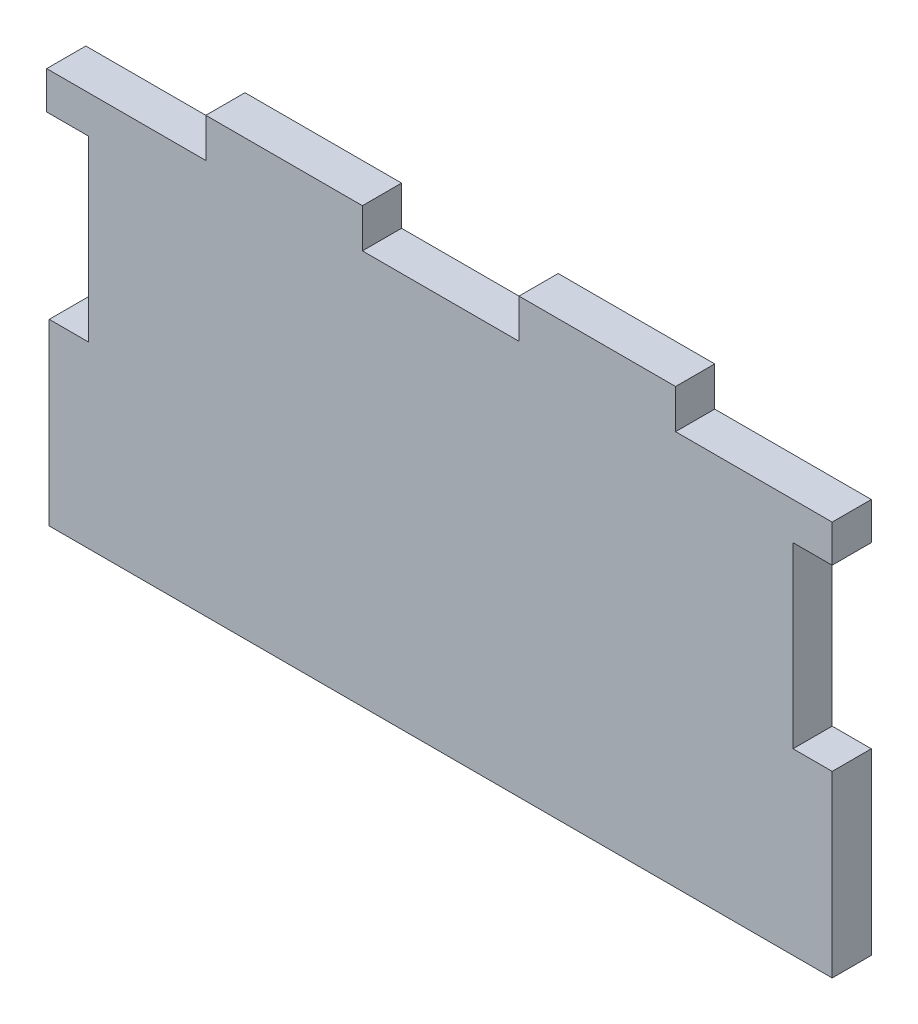
ISO-10303-21;
HEADER;
FILE_DESCRIPTION(('STEP AP214'),'2;1');
FILE_NAME('part.step','',(''),(''),'','','');
FILE_SCHEMA(('AUTOMOTIVE_DESIGN { 1 0 10303 214 1 1 1 1 }'));
ENDSEC;
DATA;
#1=APPLICATION_CONTEXT('core data for automotive mechanical design processes');
#2=APPLICATION_PROTOCOL_DEFINITION('international standard','automotive_design',2000,#1);
#3=PRODUCT_CONTEXT('',#1,'mechanical');
#4=PRODUCT('Part','Part','',(#3));
#5=PRODUCT_RELATED_PRODUCT_CATEGORY('part','',(#4));
#6=PRODUCT_DEFINITION_FORMATION('','',#4);
#7=PRODUCT_DEFINITION_CONTEXT('part definition',#1,'design');
#8=PRODUCT_DEFINITION('design','',#6,#7);
#9=PRODUCT_DEFINITION_SHAPE('','',#8);
#10=(LENGTH_UNIT() NAMED_UNIT(*) SI_UNIT(.MILLI.,.METRE.));
#11=(NAMED_UNIT(*) PLANE_ANGLE_UNIT() SI_UNIT($,.RADIAN.));
#12=(NAMED_UNIT(*) SI_UNIT($,.STERADIAN.) SOLID_ANGLE_UNIT());
#13=UNCERTAINTY_MEASURE_WITH_UNIT(LENGTH_MEASURE(1.E-05),#10,'distance_accuracy_value','');
#14=(GEOMETRIC_REPRESENTATION_CONTEXT(3) GLOBAL_UNCERTAINTY_ASSIGNED_CONTEXT((#13)) GLOBAL_UNIT_ASSIGNED_CONTEXT((#10,
#11,#12)) REPRESENTATION_CONTEXT('',''));
#15=CARTESIAN_POINT('',(0.,0.,0.));
#16=DIRECTION('',(0.,0.,1.));
#17=DIRECTION('',(1.,0.,0.));
#18=AXIS2_PLACEMENT_3D('',#15,#16,#17);
#19=CARTESIAN_POINT('',(63.5,76.2,0.));
#20=DIRECTION('',(0.,0.,-1.));
#21=DIRECTION('',(-1.,0.,0.));
#22=AXIS2_PLACEMENT_3D('',#19,#20,#21);
#23=PLANE('',#22);
#24=DIRECTION('',(-1.,0.,0.));
#25=VECTOR('',#24,1.);
#26=CARTESIAN_POINT('',(63.5,-47.0262857142857,0.));
#27=LINE('',#26,#25);
#28=CARTESIAN_POINT('',(63.5,-47.0262857142857,0.));
#29=VERTEX_POINT('',#28);
#30=CARTESIAN_POINT('',(-63.5000000000001,-47.0262857142858,0.));
#31=VERTEX_POINT('',#30);
#32=EDGE_CURVE('E301',#29,#31,#27,.T.);
#33=ORIENTED_EDGE('',*,*,#32,.T.);
#34=DIRECTION('',(0.,-1.,0.));
#35=VECTOR('',#34,1.);
#36=CARTESIAN_POINT('',(-63.5,-76.2,0.));
#37=LINE('',#36,#35);
#38=CARTESIAN_POINT('',(-63.5,-17.9977142857143,0.));
#39=VERTEX_POINT('',#38);
#40=EDGE_CURVE('E37',#39,#31,#37,.T.);
#41=ORIENTED_EDGE('',*,*,#40,.F.);
#42=DIRECTION('',(1.,0.,0.));
#43=VECTOR('',#42,1.);
#44=CARTESIAN_POINT('',(-63.5000000000001,-17.9977142857143,0.));
#45=LINE('',#44,#43);
#46=CARTESIAN_POINT('',(-57.1500000000001,-17.9977142857143,0.));
#47=VERTEX_POINT('',#46);
#48=EDGE_CURVE('E284',#39,#47,#45,.T.);
#49=ORIENTED_EDGE('',*,*,#48,.T.);
#50=DIRECTION('',(0.,1.,0.));
#51=VECTOR('',#50,1.);
#52=CARTESIAN_POINT('',(-57.1500000000001,-134.112,-1.04083408558608E-13));
#53=LINE('',#52,#51);
#54=CARTESIAN_POINT('',(-57.1500000000001,10.9219999999999,-1.04083408558608E-13));
#55=VERTEX_POINT('',#54);
#56=EDGE_CURVE('E193',#47,#55,#53,.T.);
#57=ORIENTED_EDGE('',*,*,#56,.T.);
#58=DIRECTION('',(1.,0.,0.));
#59=VECTOR('',#58,1.);
#60=CARTESIAN_POINT('',(-57.1500000000001,10.9219999999999,-1.04083408558608E-13));
#61=LINE('',#60,#59);
#62=CARTESIAN_POINT('',(-63.9142109076712,10.9219999999999,-1.04083408558608E-13));
#63=VERTEX_POINT('',#62);
#64=EDGE_CURVE('E176',#63,#55,#61,.T.);
#65=ORIENTED_EDGE('',*,*,#64,.F.);
#66=DIRECTION('',(0.,-1.,0.));
#67=VECTOR('',#66,1.);
#68=CARTESIAN_POINT('',(-63.9142109076712,10.9219999999999,-1.04083408558608E-13));
#69=LINE('',#68,#67);
#70=CARTESIAN_POINT('',(-63.9142109076712,17.018,-1.04083408558608E-13));
#71=VERTEX_POINT('',#70);
#72=EDGE_CURVE('E190',#71,#63,#69,.T.);
#73=ORIENTED_EDGE('',*,*,#72,.F.);
#74=DIRECTION('',(-1.,0.,0.));
#75=VECTOR('',#74,1.);
#76=CARTESIAN_POINT('',(-63.5,17.018,0.));
#77=LINE('',#76,#75);
#78=CARTESIAN_POINT('',(-38.1,17.018,0.));
#79=VERTEX_POINT('',#78);
#80=EDGE_CURVE('E256',#79,#71,#77,.T.);
#81=ORIENTED_EDGE('',*,*,#80,.F.);
#82=DIRECTION('',(0.,1.,0.));
#83=VECTOR('',#82,1.);
#84=CARTESIAN_POINT('',(-38.1,17.018,0.));
#85=LINE('',#84,#83);
#86=CARTESIAN_POINT('',(-38.1,23.368,0.));
#87=VERTEX_POINT('',#86);
#88=EDGE_CURVE('E253',#79,#87,#85,.T.);
#89=ORIENTED_EDGE('',*,*,#88,.T.);
#90=DIRECTION('',(1.,0.,0.));
#91=VECTOR('',#90,1.);
#92=CARTESIAN_POINT('',(57.15,23.368,0.));
#93=LINE('',#92,#91);
#94=CARTESIAN_POINT('',(-12.7,23.368,0.));
#95=VERTEX_POINT('',#94);
#96=EDGE_CURVE('E274',#87,#95,#93,.T.);
#97=ORIENTED_EDGE('',*,*,#96,.T.);
#98=DIRECTION('',(0.,1.,0.));
#99=VECTOR('',#98,1.);
#100=CARTESIAN_POINT('',(-12.7,17.018,0.));
#101=LINE('',#100,#99);
#102=CARTESIAN_POINT('',(-12.7,17.018,0.));
#103=VERTEX_POINT('',#102);
#104=EDGE_CURVE('E257',#103,#95,#101,.T.);
#105=ORIENTED_EDGE('',*,*,#104,.F.);
#106=CARTESIAN_POINT('',(12.7,17.018,0.));
#107=VERTEX_POINT('',#106);
#108=EDGE_CURVE('E266',#107,#103,#77,.T.);
#109=ORIENTED_EDGE('',*,*,#108,.F.);
#110=DIRECTION('',(0.,1.,0.));
#111=VECTOR('',#110,1.);
#112=CARTESIAN_POINT('',(12.7,17.018,0.));
#113=LINE('',#112,#111);
#114=CARTESIAN_POINT('',(12.7,23.368,0.));
#115=VERTEX_POINT('',#114);
#116=EDGE_CURVE('E232',#107,#115,#113,.T.);
#117=ORIENTED_EDGE('',*,*,#116,.T.);
#118=CARTESIAN_POINT('',(38.1,23.368,0.));
#119=VERTEX_POINT('',#118);
#120=EDGE_CURVE('E275',#115,#119,#93,.T.);
#121=ORIENTED_EDGE('',*,*,#120,.T.);
#122=DIRECTION('',(0.,1.,0.));
#123=VECTOR('',#122,1.);
#124=CARTESIAN_POINT('',(38.1,17.018,0.));
#125=LINE('',#124,#123);
#126=CARTESIAN_POINT('',(38.1,17.018,0.));
#127=VERTEX_POINT('',#126);
#128=EDGE_CURVE('E58',#127,#119,#125,.T.);
#129=ORIENTED_EDGE('',*,*,#128,.F.);
#130=CARTESIAN_POINT('',(63.5,17.018,-1.04083408558608E-13));
#131=VERTEX_POINT('',#130);
#132=EDGE_CURVE('E263',#131,#127,#77,.T.);
#133=ORIENTED_EDGE('',*,*,#132,.F.);
#134=DIRECTION('',(0.,1.,0.));
#135=VECTOR('',#134,1.);
#136=CARTESIAN_POINT('',(63.5,10.9582857142857,-1.04083408558608E-13));
#137=LINE('',#136,#135);
#138=CARTESIAN_POINT('',(63.5,10.9582857142857,-1.04083408558608E-13));
#139=VERTEX_POINT('',#138);
#140=EDGE_CURVE('E208',#139,#131,#137,.T.);
#141=ORIENTED_EDGE('',*,*,#140,.F.);
#142=DIRECTION('',(1.,0.,0.));
#143=VECTOR('',#142,1.);
#144=CARTESIAN_POINT('',(57.15,10.9582857142857,-1.04083408558608E-13));
#145=LINE('',#144,#143);
#146=CARTESIAN_POINT('',(57.15,10.9582857142857,-1.04083408558608E-13));
#147=VERTEX_POINT('',#146);
#148=EDGE_CURVE('E205',#147,#139,#145,.T.);
#149=ORIENTED_EDGE('',*,*,#148,.F.);
#150=DIRECTION('',(0.,-1.,0.));
#151=VECTOR('',#150,1.);
#152=CARTESIAN_POINT('',(57.15,-134.112,0.));
#153=LINE('',#152,#151);
#154=CARTESIAN_POINT('',(57.15,-17.9977142857143,0.));
#155=VERTEX_POINT('',#154);
#156=EDGE_CURVE('E307',#147,#155,#153,.T.);
#157=ORIENTED_EDGE('',*,*,#156,.T.);
#158=DIRECTION('',(-1.,0.,0.));
#159=VECTOR('',#158,1.);
#160=CARTESIAN_POINT('',(63.5,-17.9977142857143,0.));
#161=LINE('',#160,#159);
#162=CARTESIAN_POINT('',(63.5,-17.9977142857143,0.));
#163=VERTEX_POINT('',#162);
#164=EDGE_CURVE('E304',#163,#155,#161,.T.);
#165=ORIENTED_EDGE('',*,*,#164,.F.);
#166=DIRECTION('',(0.,1.,0.));
#167=VECTOR('',#166,1.);
#168=CARTESIAN_POINT('',(63.5,-76.2,0.));
#169=LINE('',#168,#167);
#170=EDGE_CURVE('E317',#29,#163,#169,.T.);
#171=ORIENTED_EDGE('',*,*,#170,.F.);
#172=EDGE_LOOP('',(#33,#41,#49,#57,#65,#73,#81,#89,#97,#105,#109,#117,#121,#129,#133,#141,#149,
#157,#165,#171));
#173=FACE_BOUND('',#172,.T.);
#174=ADVANCED_FACE('F33',(#173),#23,.T.);
#175=CARTESIAN_POINT('',(57.15,23.368,6.35));
#176=DIRECTION('',(0.,1.,0.));
#177=DIRECTION('',(0.,0.,1.));
#178=AXIS2_PLACEMENT_3D('',#175,#176,#177);
#179=PLANE('',#178);
#180=ORIENTED_EDGE('',*,*,#96,.F.);
#181=DIRECTION('',(0.,0.,1.));
#182=VECTOR('',#181,1.);
#183=CARTESIAN_POINT('',(-38.1,23.368,0.));
#184=LINE('',#183,#182);
#185=CARTESIAN_POINT('',(-38.1,23.368,6.35000000000002));
#186=VERTEX_POINT('',#185);
#187=EDGE_CURVE('E235',#87,#186,#184,.T.);
#188=ORIENTED_EDGE('',*,*,#187,.T.);
#189=DIRECTION('',(1.,0.,0.));
#190=VECTOR('',#189,1.);
#191=CARTESIAN_POINT('',(57.15,23.368,6.35));
#192=LINE('',#191,#190);
#193=CARTESIAN_POINT('',(-12.7,23.368,6.35000000000002));
#194=VERTEX_POINT('',#193);
#195=EDGE_CURVE('E273',#186,#194,#192,.T.);
#196=ORIENTED_EDGE('',*,*,#195,.T.);
#197=DIRECTION('',(0.,0.,-1.));
#198=VECTOR('',#197,1.);
#199=CARTESIAN_POINT('',(-12.7,23.368,0.));
#200=LINE('',#199,#198);
#201=EDGE_CURVE('E245',#194,#95,#200,.T.);
#202=ORIENTED_EDGE('',*,*,#201,.T.);
#203=EDGE_LOOP('',(#180,#188,#196,#202));
#204=FACE_BOUND('',#203,.T.);
#205=ADVANCED_FACE('F377',(#204),#179,.T.);
#206=ORIENTED_EDGE('',*,*,#120,.F.);
#207=DIRECTION('',(0.,0.,1.));
#208=VECTOR('',#207,1.);
#209=CARTESIAN_POINT('',(12.7,23.368,0.));
#210=LINE('',#209,#208);
#211=CARTESIAN_POINT('',(12.7,23.368,6.35));
#212=VERTEX_POINT('',#211);
#213=EDGE_CURVE('E220',#115,#212,#210,.T.);
#214=ORIENTED_EDGE('',*,*,#213,.T.);
#215=CARTESIAN_POINT('',(38.1,23.368,6.35000000000002));
#216=VERTEX_POINT('',#215);
#217=EDGE_CURVE('E270',#212,#216,#192,.T.);
#218=ORIENTED_EDGE('',*,*,#217,.T.);
#219=DIRECTION('',(0.,0.,-1.));
#220=VECTOR('',#219,1.);
#221=CARTESIAN_POINT('',(38.1,23.368,0.));
#222=LINE('',#221,#220);
#223=EDGE_CURVE('E228',#216,#119,#222,.T.);
#224=ORIENTED_EDGE('',*,*,#223,.T.);
#225=EDGE_LOOP('',(#206,#214,#218,#224));
#226=FACE_BOUND('',#225,.T.);
#227=ADVANCED_FACE('F394',(#226),#179,.T.);
#228=CARTESIAN_POINT('',(63.5,76.2,6.35));
#229=DIRECTION('',(0.,0.,-1.));
#230=DIRECTION('',(-1.,0.,0.));
#231=AXIS2_PLACEMENT_3D('',#228,#229,#230);
#232=PLANE('',#231);
#233=DIRECTION('',(0.,-1.,0.));
#234=VECTOR('',#233,1.);
#235=CARTESIAN_POINT('',(-63.5,-76.2,6.35));
#236=LINE('',#235,#234);
#237=CARTESIAN_POINT('',(-63.5000000000001,-17.9977142857143,6.34999999999993));
#238=VERTEX_POINT('',#237);
#239=CARTESIAN_POINT('',(-63.5,-47.0262857142857,6.35));
#240=VERTEX_POINT('',#239);
#241=EDGE_CURVE('E11',#238,#240,#236,.T.);
#242=ORIENTED_EDGE('',*,*,#241,.T.);
#243=DIRECTION('',(-1.,0.,0.));
#244=VECTOR('',#243,1.);
#245=CARTESIAN_POINT('',(63.5,-47.0262857142857,6.34999999999991));
#246=LINE('',#245,#244);
#247=CARTESIAN_POINT('',(63.5,-47.0262857142857,6.34999999999992));
#248=VERTEX_POINT('',#247);
#249=EDGE_CURVE('E311',#248,#240,#246,.T.);
#250=ORIENTED_EDGE('',*,*,#249,.F.);
#251=DIRECTION('',(0.,1.,0.));
#252=VECTOR('',#251,1.);
#253=CARTESIAN_POINT('',(63.5,-76.2,6.35));
#254=LINE('',#253,#252);
#255=CARTESIAN_POINT('',(63.5,-17.9977142857143,6.34999999999991));
#256=VERTEX_POINT('',#255);
#257=EDGE_CURVE('E42',#248,#256,#254,.T.);
#258=ORIENTED_EDGE('',*,*,#257,.T.);
#259=DIRECTION('',(-1.,0.,0.));
#260=VECTOR('',#259,1.);
#261=CARTESIAN_POINT('',(63.5,-17.9977142857143,6.34999999999991));
#262=LINE('',#261,#260);
#263=CARTESIAN_POINT('',(57.15,-17.9977142857143,6.34999999999991));
#264=VERTEX_POINT('',#263);
#265=EDGE_CURVE('E308',#256,#264,#262,.T.);
#266=ORIENTED_EDGE('',*,*,#265,.T.);
#267=DIRECTION('',(0.,-1.,0.));
#268=VECTOR('',#267,1.);
#269=CARTESIAN_POINT('',(57.15,76.2,6.35));
#270=LINE('',#269,#268);
#271=CARTESIAN_POINT('',(57.15,10.9582857142857,6.35));
#272=VERTEX_POINT('',#271);
#273=EDGE_CURVE('E315',#272,#264,#270,.T.);
#274=ORIENTED_EDGE('',*,*,#273,.F.);
#275=DIRECTION('',(1.,0.,0.));
#276=VECTOR('',#275,1.);
#277=CARTESIAN_POINT('',(57.15,10.9582857142857,6.35));
#278=LINE('',#277,#276);
#279=CARTESIAN_POINT('',(63.5,10.9582857142857,6.35));
#280=VERTEX_POINT('',#279);
#281=EDGE_CURVE('E203',#272,#280,#278,.T.);
#282=ORIENTED_EDGE('',*,*,#281,.T.);
#283=DIRECTION('',(0.,1.,0.));
#284=VECTOR('',#283,1.);
#285=CARTESIAN_POINT('',(63.5,10.9582857142857,6.35));
#286=LINE('',#285,#284);
#287=CARTESIAN_POINT('',(63.5,17.018,6.35));
#288=VERTEX_POINT('',#287);
#289=EDGE_CURVE('E209',#280,#288,#286,.T.);
#290=ORIENTED_EDGE('',*,*,#289,.T.);
#291=DIRECTION('',(-1.,0.,0.));
#292=VECTOR('',#291,1.);
#293=CARTESIAN_POINT('',(63.5,17.018,6.35));
#294=LINE('',#293,#292);
#295=CARTESIAN_POINT('',(38.1,17.018,6.35000000000002));
#296=VERTEX_POINT('',#295);
#297=EDGE_CURVE('E268',#288,#296,#294,.T.);
#298=ORIENTED_EDGE('',*,*,#297,.T.);
#299=DIRECTION('',(0.,1.,0.));
#300=VECTOR('',#299,1.);
#301=CARTESIAN_POINT('',(38.1,17.018,6.35000000000002));
#302=LINE('',#301,#300);
#303=EDGE_CURVE('E237',#296,#216,#302,.T.);
#304=ORIENTED_EDGE('',*,*,#303,.T.);
#305=ORIENTED_EDGE('',*,*,#217,.F.);
#306=DIRECTION('',(0.,1.,0.));
#307=VECTOR('',#306,1.);
#308=CARTESIAN_POINT('',(12.7,17.018,6.35000000000002));
#309=LINE('',#308,#307);
#310=CARTESIAN_POINT('',(12.7,17.018,6.35000000000002));
#311=VERTEX_POINT('',#310);
#312=EDGE_CURVE('E50',#311,#212,#309,.T.);
#313=ORIENTED_EDGE('',*,*,#312,.F.);
#314=CARTESIAN_POINT('',(-12.7,17.018,6.35000000000002));
#315=VERTEX_POINT('',#314);
#316=EDGE_CURVE('E269',#311,#315,#294,.T.);
#317=ORIENTED_EDGE('',*,*,#316,.T.);
#318=DIRECTION('',(0.,1.,0.));
#319=VECTOR('',#318,1.);
#320=CARTESIAN_POINT('',(-12.7,17.018,6.35000000000002));
#321=LINE('',#320,#319);
#322=EDGE_CURVE('E259',#315,#194,#321,.T.);
#323=ORIENTED_EDGE('',*,*,#322,.T.);
#324=ORIENTED_EDGE('',*,*,#195,.F.);
#325=DIRECTION('',(0.,1.,0.));
#326=VECTOR('',#325,1.);
#327=CARTESIAN_POINT('',(-38.1,17.018,6.35000000000002));
#328=LINE('',#327,#326);
#329=CARTESIAN_POINT('',(-38.1,17.018,6.35000000000002));
#330=VERTEX_POINT('',#329);
#331=EDGE_CURVE('E248',#330,#186,#328,.T.);
#332=ORIENTED_EDGE('',*,*,#331,.F.);
#333=CARTESIAN_POINT('',(-63.9142109076712,17.018,6.35));
#334=VERTEX_POINT('',#333);
#335=EDGE_CURVE('E265',#330,#334,#294,.T.);
#336=ORIENTED_EDGE('',*,*,#335,.T.);
#337=DIRECTION('',(0.,-1.,0.));
#338=VECTOR('',#337,1.);
#339=CARTESIAN_POINT('',(-63.9142109076712,10.9219999999999,6.35));
#340=LINE('',#339,#338);
#341=CARTESIAN_POINT('',(-63.9142109076712,10.9219999999999,6.35));
#342=VERTEX_POINT('',#341);
#343=EDGE_CURVE('E199',#334,#342,#340,.T.);
#344=ORIENTED_EDGE('',*,*,#343,.T.);
#345=DIRECTION('',(1.,0.,0.));
#346=VECTOR('',#345,1.);
#347=CARTESIAN_POINT('',(-57.1500000000001,10.9219999999999,6.35));
#348=LINE('',#347,#346);
#349=CARTESIAN_POINT('',(-57.1500000000001,10.9219999999999,6.35));
#350=VERTEX_POINT('',#349);
#351=EDGE_CURVE('E179',#342,#350,#348,.T.);
#352=ORIENTED_EDGE('',*,*,#351,.T.);
#353=DIRECTION('',(0.,1.,0.));
#354=VECTOR('',#353,1.);
#355=CARTESIAN_POINT('',(-57.1500000000001,76.2,6.35));
#356=LINE('',#355,#354);
#357=CARTESIAN_POINT('',(-57.1500000000001,-17.9977142857143,6.34999999999993));
#358=VERTEX_POINT('',#357);
#359=EDGE_CURVE('E293',#358,#350,#356,.T.);
#360=ORIENTED_EDGE('',*,*,#359,.F.);
#361=DIRECTION('',(1.,0.,0.));
#362=VECTOR('',#361,1.);
#363=CARTESIAN_POINT('',(-63.5000000000001,-17.9977142857143,6.34999999999993));
#364=LINE('',#363,#362);
#365=EDGE_CURVE('E287',#238,#358,#364,.T.);
#366=ORIENTED_EDGE('',*,*,#365,.F.);
#367=EDGE_LOOP('',(#242,#250,#258,#266,#274,#282,#290,#298,#304,#305,#313,#317,#323,#324,#332,
#336,#344,#352,#360,#366));
#368=FACE_BOUND('',#367,.T.);
#369=ADVANCED_FACE('F337',(#368),#232,.F.);
#370=CARTESIAN_POINT('',(-63.5,-76.2,6.35));
#371=DIRECTION('',(1.,0.,0.));
#372=DIRECTION('',(0.,0.,-1.));
#373=AXIS2_PLACEMENT_3D('',#370,#371,#372);
#374=PLANE('',#373);
#375=DIRECTION('',(0.,0.,-1.));
#376=VECTOR('',#375,1.);
#377=CARTESIAN_POINT('',(-63.5000000000001,-47.0262857142858,0.));
#378=LINE('',#377,#376);
#379=EDGE_CURVE('E278',#240,#31,#378,.T.);
#380=ORIENTED_EDGE('',*,*,#379,.F.);
#381=ORIENTED_EDGE('',*,*,#241,.F.);
#382=DIRECTION('',(0.,0.,1.));
#383=VECTOR('',#382,1.);
#384=CARTESIAN_POINT('',(-63.5000000000001,-17.9977142857143,0.));
#385=LINE('',#384,#383);
#386=EDGE_CURVE('E281',#39,#238,#385,.T.);
#387=ORIENTED_EDGE('',*,*,#386,.F.);
#388=ORIENTED_EDGE('',*,*,#40,.T.);
#389=EDGE_LOOP('',(#380,#381,#387,#388));
#390=FACE_BOUND('',#389,.T.);
#391=ADVANCED_FACE('F329',(#390),#374,.F.);
#392=CARTESIAN_POINT('',(63.5,-76.2,6.35));
#393=DIRECTION('',(-1.,0.,0.));
#394=DIRECTION('',(0.,0.,1.));
#395=AXIS2_PLACEMENT_3D('',#392,#393,#394);
#396=PLANE('',#395);
#397=DIRECTION('',(0.,0.,-1.));
#398=VECTOR('',#397,1.);
#399=CARTESIAN_POINT('',(63.5,-17.9977142857143,0.));
#400=LINE('',#399,#398);
#401=EDGE_CURVE('E299',#256,#163,#400,.T.);
#402=ORIENTED_EDGE('',*,*,#401,.F.);
#403=ORIENTED_EDGE('',*,*,#257,.F.);
#404=DIRECTION('',(0.,0.,1.));
#405=VECTOR('',#404,1.);
#406=CARTESIAN_POINT('',(63.5,-47.0262857142857,0.));
#407=LINE('',#406,#405);
#408=EDGE_CURVE('E297',#29,#248,#407,.T.);
#409=ORIENTED_EDGE('',*,*,#408,.F.);
#410=ORIENTED_EDGE('',*,*,#170,.T.);
#411=EDGE_LOOP('',(#402,#403,#409,#410));
#412=FACE_BOUND('',#411,.T.);
#413=ADVANCED_FACE('F35',(#412),#396,.F.);
#414=CARTESIAN_POINT('',(57.15,69.088,114.3));
#415=DIRECTION('',(1.,0.,0.));
#416=DIRECTION('',(0.,0.,-1.));
#417=AXIS2_PLACEMENT_3D('',#414,#415,#416);
#418=PLANE('',#417);
#419=DIRECTION('',(0.,0.,1.));
#420=VECTOR('',#419,1.);
#421=CARTESIAN_POINT('',(57.15,10.9582857142857,-1.04083408558608E-13));
#422=LINE('',#421,#420);
#423=EDGE_CURVE('E212',#147,#272,#422,.T.);
#424=ORIENTED_EDGE('',*,*,#423,.T.);
#425=ORIENTED_EDGE('',*,*,#273,.T.);
#426=DIRECTION('',(0.,0.,-1.));
#427=VECTOR('',#426,1.);
#428=CARTESIAN_POINT('',(57.15,-17.9977142857143,0.));
#429=LINE('',#428,#427);
#430=EDGE_CURVE('E296',#264,#155,#429,.T.);
#431=ORIENTED_EDGE('',*,*,#430,.T.);
#432=ORIENTED_EDGE('',*,*,#156,.F.);
#433=EDGE_LOOP('',(#424,#425,#431,#432));
#434=FACE_BOUND('',#433,.T.);
#435=ADVANCED_FACE('F346',(#434),#418,.T.);
#436=CARTESIAN_POINT('',(63.5,-17.9977142857143,0.));
#437=DIRECTION('',(0.,1.,0.));
#438=DIRECTION('',(0.,0.,-1.));
#439=AXIS2_PLACEMENT_3D('',#436,#437,#438);
#440=PLANE('',#439);
#441=ORIENTED_EDGE('',*,*,#430,.F.);
#442=ORIENTED_EDGE('',*,*,#265,.F.);
#443=ORIENTED_EDGE('',*,*,#401,.T.);
#444=ORIENTED_EDGE('',*,*,#164,.T.);
#445=EDGE_LOOP('',(#441,#442,#443,#444));
#446=FACE_BOUND('',#445,.T.);
#447=ADVANCED_FACE('F341',(#446),#440,.T.);
#448=CARTESIAN_POINT('',(63.5,-47.0262857142857,0.));
#449=DIRECTION('',(0.,-1.,0.));
#450=DIRECTION('',(0.,0.,1.));
#451=AXIS2_PLACEMENT_3D('',#448,#449,#450);
#452=PLANE('',#451);
#453=ORIENTED_EDGE('',*,*,#249,.T.);
#454=ORIENTED_EDGE('',*,*,#379,.T.);
#455=ORIENTED_EDGE('',*,*,#32,.F.);
#456=ORIENTED_EDGE('',*,*,#408,.T.);
#457=EDGE_LOOP('',(#453,#454,#455,#456));
#458=FACE_BOUND('',#457,.T.);
#459=ADVANCED_FACE('F333',(#458),#452,.T.);
#460=CARTESIAN_POINT('',(-63.5000000000001,-17.9977142857143,0.));
#461=DIRECTION('',(0.,1.,0.));
#462=DIRECTION('',(0.,0.,1.));
#463=AXIS2_PLACEMENT_3D('',#460,#461,#462);
#464=PLANE('',#463);
#465=DIRECTION('',(0.,0.,1.));
#466=VECTOR('',#465,1.);
#467=CARTESIAN_POINT('',(-57.1500000000001,-17.9977142857143,0.));
#468=LINE('',#467,#466);
#469=EDGE_CURVE('E282',#47,#358,#468,.T.);
#470=ORIENTED_EDGE('',*,*,#469,.F.);
#471=ORIENTED_EDGE('',*,*,#48,.F.);
#472=ORIENTED_EDGE('',*,*,#386,.T.);
#473=ORIENTED_EDGE('',*,*,#365,.T.);
#474=EDGE_LOOP('',(#470,#471,#472,#473));
#475=FACE_BOUND('',#474,.T.);
#476=ADVANCED_FACE('F410',(#475),#464,.T.);
#477=CARTESIAN_POINT('',(-57.1500000000001,69.088,-1.04083408558608E-13));
#478=DIRECTION('',(-1.,0.,0.));
#479=DIRECTION('',(0.,0.,1.));
#480=AXIS2_PLACEMENT_3D('',#477,#478,#479);
#481=PLANE('',#480);
#482=ORIENTED_EDGE('',*,*,#359,.T.);
#483=DIRECTION('',(0.,0.,-1.));
#484=VECTOR('',#483,1.);
#485=CARTESIAN_POINT('',(-57.1500000000001,10.922,0.));
#486=LINE('',#485,#484);
#487=EDGE_CURVE('E291',#350,#55,#486,.T.);
#488=ORIENTED_EDGE('',*,*,#487,.T.);
#489=ORIENTED_EDGE('',*,*,#56,.F.);
#490=ORIENTED_EDGE('',*,*,#469,.T.);
#491=EDGE_LOOP('',(#482,#488,#489,#490));
#492=FACE_BOUND('',#491,.T.);
#493=ADVANCED_FACE('F413',(#492),#481,.T.);
#494=CARTESIAN_POINT('',(63.5,17.018,0.));
#495=DIRECTION('',(0.,-1.,0.));
#496=DIRECTION('',(0.,0.,-1.));
#497=AXIS2_PLACEMENT_3D('',#494,#495,#496);
#498=PLANE('',#497);
#499=DIRECTION('',(0.,0.,1.));
#500=VECTOR('',#499,1.);
#501=CARTESIAN_POINT('',(-38.1,17.018,0.));
#502=LINE('',#501,#500);
#503=EDGE_CURVE('E241',#79,#330,#502,.T.);
#504=ORIENTED_EDGE('',*,*,#503,.F.);
#505=ORIENTED_EDGE('',*,*,#80,.T.);
#506=DIRECTION('',(0.,0.,1.));
#507=VECTOR('',#506,1.);
#508=CARTESIAN_POINT('',(-63.9142109076712,17.018,-1.04083408558608E-13));
#509=LINE('',#508,#507);
#510=EDGE_CURVE('E184',#71,#334,#509,.T.);
#511=ORIENTED_EDGE('',*,*,#510,.T.);
#512=ORIENTED_EDGE('',*,*,#335,.F.);
#513=EDGE_LOOP('',(#504,#505,#511,#512));
#514=FACE_BOUND('',#513,.T.);
#515=ADVANCED_FACE('F372',(#514),#498,.F.);
#516=CARTESIAN_POINT('',(-38.1,17.018,0.));
#517=DIRECTION('',(-1.,0.,0.));
#518=DIRECTION('',(0.,0.,1.));
#519=AXIS2_PLACEMENT_3D('',#516,#517,#518);
#520=PLANE('',#519);
#521=ORIENTED_EDGE('',*,*,#187,.F.);
#522=ORIENTED_EDGE('',*,*,#88,.F.);
#523=ORIENTED_EDGE('',*,*,#503,.T.);
#524=ORIENTED_EDGE('',*,*,#331,.T.);
#525=EDGE_LOOP('',(#521,#522,#523,#524));
#526=FACE_BOUND('',#525,.T.);
#527=ADVANCED_FACE('F450',(#526),#520,.T.);
#528=CARTESIAN_POINT('',(38.1,17.018,0.));
#529=DIRECTION('',(1.,0.,0.));
#530=DIRECTION('',(0.,0.,-1.));
#531=AXIS2_PLACEMENT_3D('',#528,#529,#530);
#532=PLANE('',#531);
#533=ORIENTED_EDGE('',*,*,#223,.F.);
#534=ORIENTED_EDGE('',*,*,#303,.F.);
#535=DIRECTION('',(0.,0.,-1.));
#536=VECTOR('',#535,1.);
#537=CARTESIAN_POINT('',(38.1,17.018,0.));
#538=LINE('',#537,#536);
#539=EDGE_CURVE('E227',#296,#127,#538,.T.);
#540=ORIENTED_EDGE('',*,*,#539,.T.);
#541=ORIENTED_EDGE('',*,*,#128,.T.);
#542=EDGE_LOOP('',(#533,#534,#540,#541));
#543=FACE_BOUND('',#542,.T.);
#544=ADVANCED_FACE('F457',(#543),#532,.T.);
#545=ORIENTED_EDGE('',*,*,#297,.F.);
#546=DIRECTION('',(0.,0.,1.));
#547=VECTOR('',#546,1.);
#548=CARTESIAN_POINT('',(63.5,17.018,-1.04083408558608E-13));
#549=LINE('',#548,#547);
#550=EDGE_CURVE('E217',#131,#288,#549,.T.);
#551=ORIENTED_EDGE('',*,*,#550,.F.);
#552=ORIENTED_EDGE('',*,*,#132,.T.);
#553=ORIENTED_EDGE('',*,*,#539,.F.);
#554=EDGE_LOOP('',(#545,#551,#552,#553));
#555=FACE_BOUND('',#554,.T.);
#556=ADVANCED_FACE('F356',(#555),#498,.F.);
#557=DIRECTION('',(0.,0.,1.));
#558=VECTOR('',#557,1.);
#559=CARTESIAN_POINT('',(12.7,17.018,0.));
#560=LINE('',#559,#558);
#561=EDGE_CURVE('E225',#107,#311,#560,.T.);
#562=ORIENTED_EDGE('',*,*,#561,.F.);
#563=ORIENTED_EDGE('',*,*,#108,.T.);
#564=DIRECTION('',(0.,0.,-1.));
#565=VECTOR('',#564,1.);
#566=CARTESIAN_POINT('',(-12.7,17.018,0.));
#567=LINE('',#566,#565);
#568=EDGE_CURVE('E244',#315,#103,#567,.T.);
#569=ORIENTED_EDGE('',*,*,#568,.F.);
#570=ORIENTED_EDGE('',*,*,#316,.F.);
#571=EDGE_LOOP('',(#562,#563,#569,#570));
#572=FACE_BOUND('',#571,.T.);
#573=ADVANCED_FACE('F364',(#572),#498,.F.);
#574=CARTESIAN_POINT('',(-12.7,17.018,0.));
#575=DIRECTION('',(1.,0.,0.));
#576=DIRECTION('',(0.,0.,-1.));
#577=AXIS2_PLACEMENT_3D('',#574,#575,#576);
#578=PLANE('',#577);
#579=ORIENTED_EDGE('',*,*,#201,.F.);
#580=ORIENTED_EDGE('',*,*,#322,.F.);
#581=ORIENTED_EDGE('',*,*,#568,.T.);
#582=ORIENTED_EDGE('',*,*,#104,.T.);
#583=EDGE_LOOP('',(#579,#580,#581,#582));
#584=FACE_BOUND('',#583,.T.);
#585=ADVANCED_FACE('F379',(#584),#578,.T.);
#586=CARTESIAN_POINT('',(12.7,17.018,0.));
#587=DIRECTION('',(-1.,0.,0.));
#588=DIRECTION('',(0.,0.,1.));
#589=AXIS2_PLACEMENT_3D('',#586,#587,#588);
#590=PLANE('',#589);
#591=ORIENTED_EDGE('',*,*,#213,.F.);
#592=ORIENTED_EDGE('',*,*,#116,.F.);
#593=ORIENTED_EDGE('',*,*,#561,.T.);
#594=ORIENTED_EDGE('',*,*,#312,.T.);
#595=EDGE_LOOP('',(#591,#592,#593,#594));
#596=FACE_BOUND('',#595,.T.);
#597=ADVANCED_FACE('F366',(#596),#590,.T.);
#598=CARTESIAN_POINT('',(63.5,10.9582857142857,-1.04083408558608E-13));
#599=DIRECTION('',(1.,0.,0.));
#600=DIRECTION('',(0.,0.,-1.));
#601=AXIS2_PLACEMENT_3D('',#598,#599,#600);
#602=PLANE('',#601);
#603=ORIENTED_EDGE('',*,*,#289,.F.);
#604=DIRECTION('',(0.,0.,1.));
#605=VECTOR('',#604,1.);
#606=CARTESIAN_POINT('',(63.5,10.9582857142857,-1.04083408558608E-13));
#607=LINE('',#606,#605);
#608=EDGE_CURVE('E221',#139,#280,#607,.T.);
#609=ORIENTED_EDGE('',*,*,#608,.F.);
#610=ORIENTED_EDGE('',*,*,#140,.T.);
#611=ORIENTED_EDGE('',*,*,#550,.T.);
#612=EDGE_LOOP('',(#603,#609,#610,#611));
#613=FACE_BOUND('',#612,.T.);
#614=ADVANCED_FACE('F353',(#613),#602,.T.);
#615=CARTESIAN_POINT('',(57.15,10.9582857142857,-1.04083408558608E-13));
#616=DIRECTION('',(0.,-1.,0.));
#617=DIRECTION('',(0.,0.,-1.));
#618=AXIS2_PLACEMENT_3D('',#615,#616,#617);
#619=PLANE('',#618);
#620=ORIENTED_EDGE('',*,*,#281,.F.);
#621=ORIENTED_EDGE('',*,*,#423,.F.);
#622=ORIENTED_EDGE('',*,*,#148,.T.);
#623=ORIENTED_EDGE('',*,*,#608,.T.);
#624=EDGE_LOOP('',(#620,#621,#622,#623));
#625=FACE_BOUND('',#624,.T.);
#626=ADVANCED_FACE('F351',(#625),#619,.T.);
#627=CARTESIAN_POINT('',(-63.9142109076712,10.9219999999999,-1.04083408558608E-13));
#628=DIRECTION('',(-1.,0.,0.));
#629=DIRECTION('',(0.,0.,1.));
#630=AXIS2_PLACEMENT_3D('',#627,#628,#629);
#631=PLANE('',#630);
#632=ORIENTED_EDGE('',*,*,#343,.F.);
#633=ORIENTED_EDGE('',*,*,#510,.F.);
#634=ORIENTED_EDGE('',*,*,#72,.T.);
#635=DIRECTION('',(0.,0.,1.));
#636=VECTOR('',#635,1.);
#637=CARTESIAN_POINT('',(-63.9142109076712,10.9219999999999,-1.04083408558608E-13));
#638=LINE('',#637,#636);
#639=EDGE_CURVE('E173',#63,#342,#638,.T.);
#640=ORIENTED_EDGE('',*,*,#639,.T.);
#641=EDGE_LOOP('',(#632,#633,#634,#640));
#642=FACE_BOUND('',#641,.T.);
#643=ADVANCED_FACE('F196',(#642),#631,.T.);
#644=CARTESIAN_POINT('',(-57.1500000000001,10.9219999999999,-1.04083408558608E-13));
#645=DIRECTION('',(0.,-1.,0.));
#646=DIRECTION('',(0.,0.,-1.));
#647=AXIS2_PLACEMENT_3D('',#644,#645,#646);
#648=PLANE('',#647);
#649=ORIENTED_EDGE('',*,*,#351,.F.);
#650=ORIENTED_EDGE('',*,*,#639,.F.);
#651=ORIENTED_EDGE('',*,*,#64,.T.);
#652=ORIENTED_EDGE('',*,*,#487,.F.);
#653=EDGE_LOOP('',(#649,#650,#651,#652));
#654=FACE_BOUND('',#653,.T.);
#655=ADVANCED_FACE('F175',(#654),#648,.T.);
#656=CLOSED_SHELL('',(#174,#205,#227,#369,#391,#413,#435,#447,#459,#476,#493,#515,#527,#544,
#556,#573,#585,#597,#614,#626,#643,#655));
#657=MANIFOLD_SOLID_BREP('B2',#656);
#658=ADVANCED_BREP_SHAPE_REPRESENTATION('',(#18,#657),#14);
#659=SHAPE_DEFINITION_REPRESENTATION(#9,#658);
ENDSEC;
END-ISO-10303-21;
